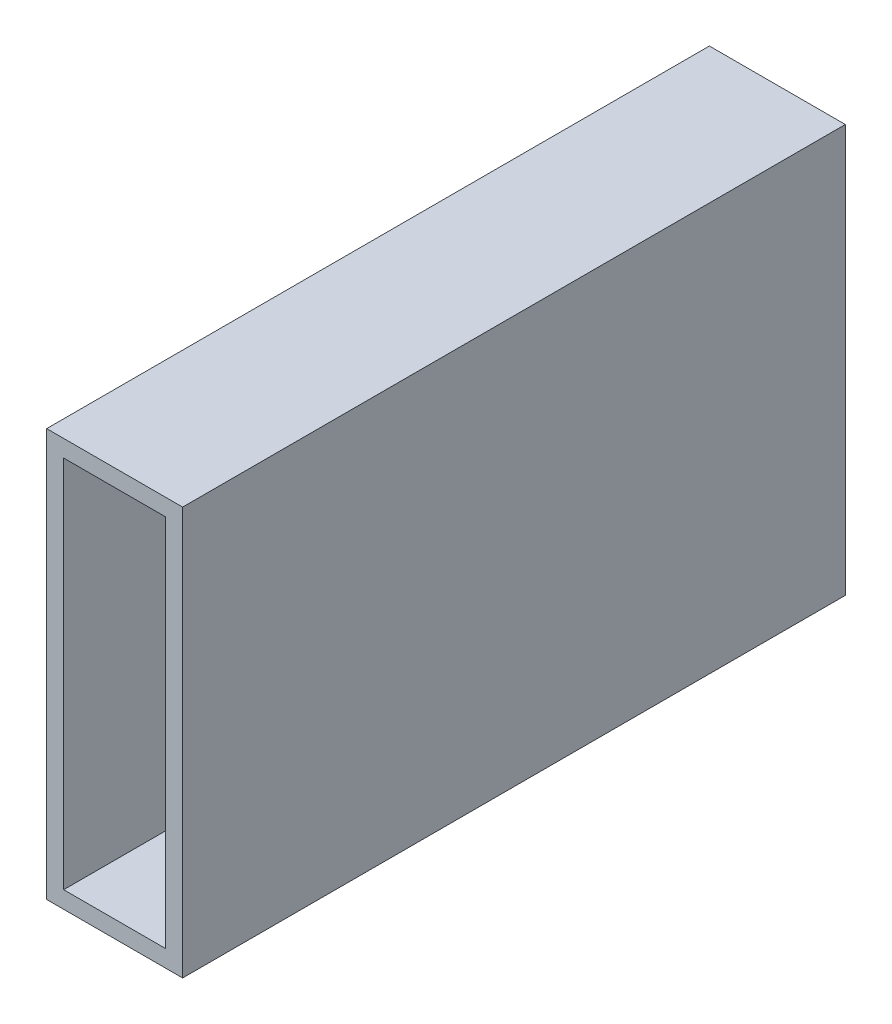
ISO-10303-21;
HEADER;
FILE_DESCRIPTION(('STEP AP214'),'2;1');
FILE_NAME('part.step','',(''),(''),'','','');
FILE_SCHEMA(('AUTOMOTIVE_DESIGN { 1 0 10303 214 1 1 1 1 }'));
ENDSEC;
DATA;
#1=APPLICATION_CONTEXT('core data for automotive mechanical design processes');
#2=APPLICATION_PROTOCOL_DEFINITION('international standard','automotive_design',2000,#1);
#3=PRODUCT_CONTEXT('',#1,'mechanical');
#4=PRODUCT('Part','Part','',(#3));
#5=PRODUCT_RELATED_PRODUCT_CATEGORY('part','',(#4));
#6=PRODUCT_DEFINITION_FORMATION('','',#4);
#7=PRODUCT_DEFINITION_CONTEXT('part definition',#1,'design');
#8=PRODUCT_DEFINITION('design','',#6,#7);
#9=PRODUCT_DEFINITION_SHAPE('','',#8);
#10=(LENGTH_UNIT() NAMED_UNIT(*) SI_UNIT(.MILLI.,.METRE.));
#11=(NAMED_UNIT(*) PLANE_ANGLE_UNIT() SI_UNIT($,.RADIAN.));
#12=(NAMED_UNIT(*) SI_UNIT($,.STERADIAN.) SOLID_ANGLE_UNIT());
#13=UNCERTAINTY_MEASURE_WITH_UNIT(LENGTH_MEASURE(1.E-05),#10,'distance_accuracy_value','');
#14=(GEOMETRIC_REPRESENTATION_CONTEXT(3) GLOBAL_UNCERTAINTY_ASSIGNED_CONTEXT((#13)) GLOBAL_UNIT_ASSIGNED_CONTEXT((#10,
#11,#12)) REPRESENTATION_CONTEXT('',''));
#15=CARTESIAN_POINT('',(0.,0.,0.));
#16=DIRECTION('',(0.,0.,1.));
#17=DIRECTION('',(1.,0.,0.));
#18=AXIS2_PLACEMENT_3D('',#15,#16,#17);
#19=CARTESIAN_POINT('',(0.,0.,61.9125));
#20=DIRECTION('',(0.,0.,-1.));
#21=DIRECTION('',(-1.,0.,0.));
#22=AXIS2_PLACEMENT_3D('',#19,#20,#21);
#23=PLANE('',#22);
#24=DIRECTION('',(0.,1.,0.));
#25=VECTOR('',#24,1.);
#26=CARTESIAN_POINT('',(12.7,-38.1,61.9125));
#27=LINE('',#26,#25);
#28=CARTESIAN_POINT('',(12.7,-38.1,61.9125));
#29=VERTEX_POINT('',#28);
#30=CARTESIAN_POINT('',(12.7,38.1,61.9125));
#31=VERTEX_POINT('',#30);
#32=EDGE_CURVE('E130',#29,#31,#27,.T.);
#33=ORIENTED_EDGE('',*,*,#32,.T.);
#34=DIRECTION('',(-1.,0.,0.));
#35=VECTOR('',#34,1.);
#36=CARTESIAN_POINT('',(-12.7,38.1,61.9125));
#37=LINE('',#36,#35);
#38=CARTESIAN_POINT('',(-12.7,38.1,61.9125));
#39=VERTEX_POINT('',#38);
#40=EDGE_CURVE('E133',#31,#39,#37,.T.);
#41=ORIENTED_EDGE('',*,*,#40,.T.);
#42=DIRECTION('',(0.,-1.,0.));
#43=VECTOR('',#42,1.);
#44=CARTESIAN_POINT('',(-12.7,-38.1,61.9125));
#45=LINE('',#44,#43);
#46=CARTESIAN_POINT('',(-12.7,-38.1,61.9125));
#47=VERTEX_POINT('',#46);
#48=EDGE_CURVE('E136',#39,#47,#45,.T.);
#49=ORIENTED_EDGE('',*,*,#48,.T.);
#50=DIRECTION('',(1.,0.,0.));
#51=VECTOR('',#50,1.);
#52=CARTESIAN_POINT('',(-12.7,-38.1,61.9125));
#53=LINE('',#52,#51);
#54=EDGE_CURVE('E138',#47,#29,#53,.T.);
#55=ORIENTED_EDGE('',*,*,#54,.T.);
#56=EDGE_LOOP('',(#33,#41,#49,#55));
#57=FACE_BOUND('',#56,.T.);
#58=DIRECTION('',(0.,1.,0.));
#59=VECTOR('',#58,1.);
#60=CARTESIAN_POINT('',(9.525,0.,61.9125));
#61=LINE('',#60,#59);
#62=CARTESIAN_POINT('',(9.525,-34.925,61.9125));
#63=VERTEX_POINT('',#62);
#64=CARTESIAN_POINT('',(9.525,34.925,61.9125));
#65=VERTEX_POINT('',#64);
#66=EDGE_CURVE('E118',#63,#65,#61,.T.);
#67=ORIENTED_EDGE('',*,*,#66,.F.);
#68=DIRECTION('',(1.,0.,0.));
#69=VECTOR('',#68,1.);
#70=CARTESIAN_POINT('',(0.,-34.925,61.9125));
#71=LINE('',#70,#69);
#72=CARTESIAN_POINT('',(-9.525,-34.925,61.9125));
#73=VERTEX_POINT('',#72);
#74=EDGE_CURVE('E103',#73,#63,#71,.T.);
#75=ORIENTED_EDGE('',*,*,#74,.F.);
#76=DIRECTION('',(0.,-1.,0.));
#77=VECTOR('',#76,1.);
#78=CARTESIAN_POINT('',(-9.525,0.,61.9125));
#79=LINE('',#78,#77);
#80=CARTESIAN_POINT('',(-9.525,34.925,61.9125));
#81=VERTEX_POINT('',#80);
#82=EDGE_CURVE('E127',#81,#73,#79,.T.);
#83=ORIENTED_EDGE('',*,*,#82,.F.);
#84=DIRECTION('',(-1.,0.,0.));
#85=VECTOR('',#84,1.);
#86=CARTESIAN_POINT('',(0.,34.925,61.9125));
#87=LINE('',#86,#85);
#88=EDGE_CURVE('E120',#65,#81,#87,.T.);
#89=ORIENTED_EDGE('',*,*,#88,.F.);
#90=EDGE_LOOP('',(#67,#75,#83,#89));
#91=FACE_BOUND('',#90,.T.);
#92=ADVANCED_FACE('F33',(#57,#91),#23,.F.);
#93=CARTESIAN_POINT('',(0.,0.,-61.9125));
#94=DIRECTION('',(0.,0.,-1.));
#95=DIRECTION('',(-1.,0.,0.));
#96=AXIS2_PLACEMENT_3D('',#93,#94,#95);
#97=PLANE('',#96);
#98=DIRECTION('',(0.,1.,0.));
#99=VECTOR('',#98,1.);
#100=CARTESIAN_POINT('',(12.7,-38.1,-61.9125));
#101=LINE('',#100,#99);
#102=CARTESIAN_POINT('',(12.7,-38.1,-61.9125));
#103=VERTEX_POINT('',#102);
#104=CARTESIAN_POINT('',(12.7,38.1,-61.9125));
#105=VERTEX_POINT('',#104);
#106=EDGE_CURVE('E141',#103,#105,#101,.T.);
#107=ORIENTED_EDGE('',*,*,#106,.F.);
#108=DIRECTION('',(1.,0.,0.));
#109=VECTOR('',#108,1.);
#110=CARTESIAN_POINT('',(-12.7,-38.1,-61.9125));
#111=LINE('',#110,#109);
#112=CARTESIAN_POINT('',(-12.7,-38.1,-61.9125));
#113=VERTEX_POINT('',#112);
#114=EDGE_CURVE('E134',#113,#103,#111,.T.);
#115=ORIENTED_EDGE('',*,*,#114,.F.);
#116=DIRECTION('',(0.,-1.,0.));
#117=VECTOR('',#116,1.);
#118=CARTESIAN_POINT('',(-12.7,-38.1,-61.9125));
#119=LINE('',#118,#117);
#120=CARTESIAN_POINT('',(-12.7,38.1,-61.9125));
#121=VERTEX_POINT('',#120);
#122=EDGE_CURVE('E146',#121,#113,#119,.T.);
#123=ORIENTED_EDGE('',*,*,#122,.F.);
#124=DIRECTION('',(-1.,0.,0.));
#125=VECTOR('',#124,1.);
#126=CARTESIAN_POINT('',(-12.7,38.1,-61.9125));
#127=LINE('',#126,#125);
#128=EDGE_CURVE('E144',#105,#121,#127,.T.);
#129=ORIENTED_EDGE('',*,*,#128,.F.);
#130=EDGE_LOOP('',(#107,#115,#123,#129));
#131=FACE_BOUND('',#130,.T.);
#132=DIRECTION('',(1.,0.,0.));
#133=VECTOR('',#132,1.);
#134=CARTESIAN_POINT('',(0.,-34.925,-61.9125));
#135=LINE('',#134,#133);
#136=CARTESIAN_POINT('',(-9.525,-34.925,-61.9125));
#137=VERTEX_POINT('',#136);
#138=CARTESIAN_POINT('',(9.525,-34.925,-61.9125));
#139=VERTEX_POINT('',#138);
#140=EDGE_CURVE('E101',#137,#139,#135,.T.);
#141=ORIENTED_EDGE('',*,*,#140,.T.);
#142=DIRECTION('',(0.,1.,0.));
#143=VECTOR('',#142,1.);
#144=CARTESIAN_POINT('',(9.525,0.,-61.9125));
#145=LINE('',#144,#143);
#146=CARTESIAN_POINT('',(9.525,34.925,-61.9125));
#147=VERTEX_POINT('',#146);
#148=EDGE_CURVE('E109',#139,#147,#145,.T.);
#149=ORIENTED_EDGE('',*,*,#148,.T.);
#150=DIRECTION('',(-1.,0.,0.));
#151=VECTOR('',#150,1.);
#152=CARTESIAN_POINT('',(0.,34.925,-61.9125));
#153=LINE('',#152,#151);
#154=CARTESIAN_POINT('',(-9.525,34.925,-61.9125));
#155=VERTEX_POINT('',#154);
#156=EDGE_CURVE('E115',#147,#155,#153,.T.);
#157=ORIENTED_EDGE('',*,*,#156,.T.);
#158=DIRECTION('',(0.,-1.,0.));
#159=VECTOR('',#158,1.);
#160=CARTESIAN_POINT('',(-9.525,0.,-61.9125));
#161=LINE('',#160,#159);
#162=EDGE_CURVE('E55',#155,#137,#161,.T.);
#163=ORIENTED_EDGE('',*,*,#162,.T.);
#164=EDGE_LOOP('',(#141,#149,#157,#163));
#165=FACE_BOUND('',#164,.T.);
#166=ADVANCED_FACE('F117',(#131,#165),#97,.T.);
#167=CARTESIAN_POINT('',(12.7,-38.1,61.9125));
#168=DIRECTION('',(-1.,0.,0.));
#169=DIRECTION('',(0.,0.,1.));
#170=AXIS2_PLACEMENT_3D('',#167,#168,#169);
#171=PLANE('',#170);
#172=ORIENTED_EDGE('',*,*,#106,.T.);
#173=DIRECTION('',(0.,0.,-1.));
#174=VECTOR('',#173,1.);
#175=CARTESIAN_POINT('',(12.7,38.1,61.9125));
#176=LINE('',#175,#174);
#177=EDGE_CURVE('E11',#31,#105,#176,.T.);
#178=ORIENTED_EDGE('',*,*,#177,.F.);
#179=ORIENTED_EDGE('',*,*,#32,.F.);
#180=DIRECTION('',(0.,0.,-1.));
#181=VECTOR('',#180,1.);
#182=CARTESIAN_POINT('',(12.7,-38.1,61.9125));
#183=LINE('',#182,#181);
#184=EDGE_CURVE('E140',#29,#103,#183,.T.);
#185=ORIENTED_EDGE('',*,*,#184,.T.);
#186=EDGE_LOOP('',(#172,#178,#179,#185));
#187=FACE_BOUND('',#186,.T.);
#188=ADVANCED_FACE('F35',(#187),#171,.F.);
#189=CARTESIAN_POINT('',(-12.7,38.1,61.9125));
#190=DIRECTION('',(0.,-1.,0.));
#191=DIRECTION('',(0.,0.,-1.));
#192=AXIS2_PLACEMENT_3D('',#189,#190,#191);
#193=PLANE('',#192);
#194=ORIENTED_EDGE('',*,*,#128,.T.);
#195=DIRECTION('',(0.,0.,-1.));
#196=VECTOR('',#195,1.);
#197=CARTESIAN_POINT('',(-12.7,38.1,61.9125));
#198=LINE('',#197,#196);
#199=EDGE_CURVE('E41',#39,#121,#198,.T.);
#200=ORIENTED_EDGE('',*,*,#199,.F.);
#201=ORIENTED_EDGE('',*,*,#40,.F.);
#202=ORIENTED_EDGE('',*,*,#177,.T.);
#203=EDGE_LOOP('',(#194,#200,#201,#202));
#204=FACE_BOUND('',#203,.T.);
#205=ADVANCED_FACE('F173',(#204),#193,.F.);
#206=CARTESIAN_POINT('',(-12.7,-38.1,61.9125));
#207=DIRECTION('',(1.,0.,0.));
#208=DIRECTION('',(0.,0.,-1.));
#209=AXIS2_PLACEMENT_3D('',#206,#207,#208);
#210=PLANE('',#209);
#211=ORIENTED_EDGE('',*,*,#122,.T.);
#212=DIRECTION('',(0.,0.,-1.));
#213=VECTOR('',#212,1.);
#214=CARTESIAN_POINT('',(-12.7,-38.1,61.9125));
#215=LINE('',#214,#213);
#216=EDGE_CURVE('E151',#47,#113,#215,.T.);
#217=ORIENTED_EDGE('',*,*,#216,.F.);
#218=ORIENTED_EDGE('',*,*,#48,.F.);
#219=ORIENTED_EDGE('',*,*,#199,.T.);
#220=EDGE_LOOP('',(#211,#217,#218,#219));
#221=FACE_BOUND('',#220,.T.);
#222=ADVANCED_FACE('F158',(#221),#210,.F.);
#223=CARTESIAN_POINT('',(-12.7,-38.1,61.9125));
#224=DIRECTION('',(0.,1.,0.));
#225=DIRECTION('',(0.,0.,1.));
#226=AXIS2_PLACEMENT_3D('',#223,#224,#225);
#227=PLANE('',#226);
#228=ORIENTED_EDGE('',*,*,#114,.T.);
#229=ORIENTED_EDGE('',*,*,#184,.F.);
#230=ORIENTED_EDGE('',*,*,#54,.F.);
#231=ORIENTED_EDGE('',*,*,#216,.T.);
#232=EDGE_LOOP('',(#228,#229,#230,#231));
#233=FACE_BOUND('',#232,.T.);
#234=ADVANCED_FACE('F166',(#233),#227,.F.);
#235=CARTESIAN_POINT('',(9.525,-38.1,61.9125));
#236=DIRECTION('',(-1.,0.,0.));
#237=DIRECTION('',(0.,0.,1.));
#238=AXIS2_PLACEMENT_3D('',#235,#236,#237);
#239=PLANE('',#238);
#240=ORIENTED_EDGE('',*,*,#148,.F.);
#241=DIRECTION('',(0.,0.,-1.));
#242=VECTOR('',#241,1.);
#243=CARTESIAN_POINT('',(9.525,-34.925,61.9125));
#244=LINE('',#243,#242);
#245=EDGE_CURVE('E97',#63,#139,#244,.T.);
#246=ORIENTED_EDGE('',*,*,#245,.F.);
#247=ORIENTED_EDGE('',*,*,#66,.T.);
#248=DIRECTION('',(0.,0.,-1.));
#249=VECTOR('',#248,1.);
#250=CARTESIAN_POINT('',(9.525,34.925,61.9125));
#251=LINE('',#250,#249);
#252=EDGE_CURVE('E112',#65,#147,#251,.T.);
#253=ORIENTED_EDGE('',*,*,#252,.T.);
#254=EDGE_LOOP('',(#240,#246,#247,#253));
#255=FACE_BOUND('',#254,.T.);
#256=ADVANCED_FACE('F110',(#255),#239,.T.);
#257=CARTESIAN_POINT('',(-12.7,34.925,61.9125));
#258=DIRECTION('',(0.,-1.,0.));
#259=DIRECTION('',(0.,0.,-1.));
#260=AXIS2_PLACEMENT_3D('',#257,#258,#259);
#261=PLANE('',#260);
#262=ORIENTED_EDGE('',*,*,#156,.F.);
#263=ORIENTED_EDGE('',*,*,#252,.F.);
#264=ORIENTED_EDGE('',*,*,#88,.T.);
#265=DIRECTION('',(0.,0.,-1.));
#266=VECTOR('',#265,1.);
#267=CARTESIAN_POINT('',(-9.525,34.925,61.9125));
#268=LINE('',#267,#266);
#269=EDGE_CURVE('E256',#81,#155,#268,.T.);
#270=ORIENTED_EDGE('',*,*,#269,.T.);
#271=EDGE_LOOP('',(#262,#263,#264,#270));
#272=FACE_BOUND('',#271,.T.);
#273=ADVANCED_FACE('F193',(#272),#261,.T.);
#274=CARTESIAN_POINT('',(-9.525,-38.1,61.9125));
#275=DIRECTION('',(1.,0.,0.));
#276=DIRECTION('',(0.,0.,-1.));
#277=AXIS2_PLACEMENT_3D('',#274,#275,#276);
#278=PLANE('',#277);
#279=ORIENTED_EDGE('',*,*,#162,.F.);
#280=ORIENTED_EDGE('',*,*,#269,.F.);
#281=ORIENTED_EDGE('',*,*,#82,.T.);
#282=DIRECTION('',(0.,0.,-1.));
#283=VECTOR('',#282,1.);
#284=CARTESIAN_POINT('',(-9.525,-34.925,61.9125));
#285=LINE('',#284,#283);
#286=EDGE_CURVE('E48',#73,#137,#285,.T.);
#287=ORIENTED_EDGE('',*,*,#286,.T.);
#288=EDGE_LOOP('',(#279,#280,#281,#287));
#289=FACE_BOUND('',#288,.T.);
#290=ADVANCED_FACE('F198',(#289),#278,.T.);
#291=CARTESIAN_POINT('',(-12.7,-34.925,61.9125));
#292=DIRECTION('',(0.,1.,0.));
#293=DIRECTION('',(0.,0.,1.));
#294=AXIS2_PLACEMENT_3D('',#291,#292,#293);
#295=PLANE('',#294);
#296=ORIENTED_EDGE('',*,*,#140,.F.);
#297=ORIENTED_EDGE('',*,*,#286,.F.);
#298=ORIENTED_EDGE('',*,*,#74,.T.);
#299=ORIENTED_EDGE('',*,*,#245,.T.);
#300=EDGE_LOOP('',(#296,#297,#298,#299));
#301=FACE_BOUND('',#300,.T.);
#302=ADVANCED_FACE('F99',(#301),#295,.T.);
#303=CLOSED_SHELL('',(#92,#166,#188,#205,#222,#234,#256,#273,#290,#302));
#304=MANIFOLD_SOLID_BREP('B2',#303);
#305=ADVANCED_BREP_SHAPE_REPRESENTATION('',(#18,#304),#14);
#306=SHAPE_DEFINITION_REPRESENTATION(#9,#305);
ENDSEC;
END-ISO-10303-21;
